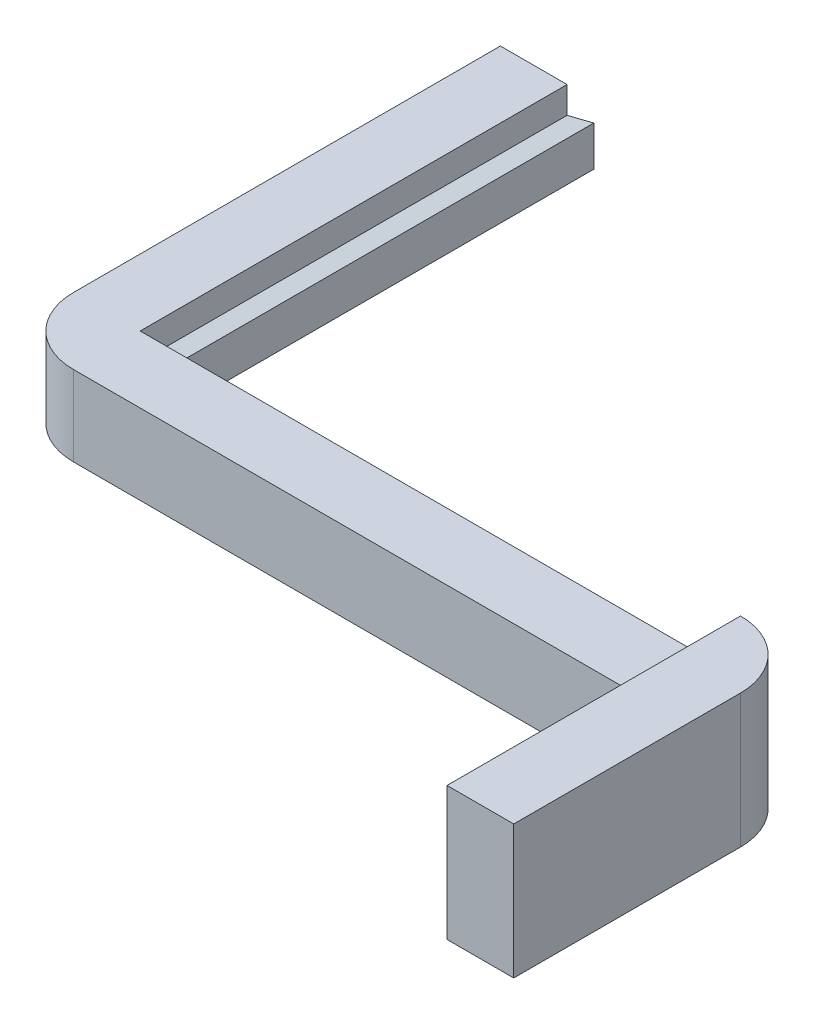
ISO-10303-21;
HEADER;
FILE_DESCRIPTION(('STEP AP214'),'2;1');
FILE_NAME('part.step','',(''),(''),'','','');
FILE_SCHEMA(('AUTOMOTIVE_DESIGN { 1 0 10303 214 1 1 1 1 }'));
ENDSEC;
DATA;
#1=APPLICATION_CONTEXT('core data for automotive mechanical design processes');
#2=APPLICATION_PROTOCOL_DEFINITION('international standard','automotive_design',2000,#1);
#3=PRODUCT_CONTEXT('',#1,'mechanical');
#4=PRODUCT('Part','Part','',(#3));
#5=PRODUCT_RELATED_PRODUCT_CATEGORY('part','',(#4));
#6=PRODUCT_DEFINITION_FORMATION('','',#4);
#7=PRODUCT_DEFINITION_CONTEXT('part definition',#1,'design');
#8=PRODUCT_DEFINITION('design','',#6,#7);
#9=PRODUCT_DEFINITION_SHAPE('','',#8);
#10=(LENGTH_UNIT() NAMED_UNIT(*) SI_UNIT(.MILLI.,.METRE.));
#11=(NAMED_UNIT(*) PLANE_ANGLE_UNIT() SI_UNIT($,.RADIAN.));
#12=(NAMED_UNIT(*) SI_UNIT($,.STERADIAN.) SOLID_ANGLE_UNIT());
#13=UNCERTAINTY_MEASURE_WITH_UNIT(LENGTH_MEASURE(1.E-05),#10,'distance_accuracy_value','');
#14=(GEOMETRIC_REPRESENTATION_CONTEXT(3) GLOBAL_UNCERTAINTY_ASSIGNED_CONTEXT((#13)) GLOBAL_UNIT_ASSIGNED_CONTEXT((#10,
#11,#12)) REPRESENTATION_CONTEXT('',''));
#15=CARTESIAN_POINT('',(0.,0.,0.));
#16=DIRECTION('',(0.,0.,1.));
#17=DIRECTION('',(1.,0.,0.));
#18=AXIS2_PLACEMENT_3D('',#15,#16,#17);
#19=CARTESIAN_POINT('',(0.,0.,0.));
#20=DIRECTION('',(0.,0.,-1.));
#21=DIRECTION('',(-1.,0.,0.));
#22=AXIS2_PLACEMENT_3D('',#19,#20,#21);
#23=PLANE('',#22);
#24=DIRECTION('',(0.,-1.,0.));
#25=VECTOR('',#24,1.);
#26=CARTESIAN_POINT('',(-20.5,1.5,0.));
#27=LINE('',#26,#25);
#28=CARTESIAN_POINT('',(-20.5,1.5,0.));
#29=VERTEX_POINT('',#28);
#30=CARTESIAN_POINT('',(-20.5,-1.5,0.));
#31=VERTEX_POINT('',#30);
#32=EDGE_CURVE('E155',#29,#31,#27,.T.);
#33=ORIENTED_EDGE('',*,*,#32,.F.);
#34=DIRECTION('',(0.970142500145332,0.242535625036333,0.));
#35=VECTOR('',#34,1.);
#36=CARTESIAN_POINT('',(-22.5,1.,0.));
#37=LINE('',#36,#35);
#38=CARTESIAN_POINT('',(-22.5,1.,0.));
#39=VERTEX_POINT('',#38);
#40=EDGE_CURVE('E164',#39,#29,#37,.T.);
#41=ORIENTED_EDGE('',*,*,#40,.F.);
#42=DIRECTION('',(0.,-1.,0.));
#43=VECTOR('',#42,1.);
#44=CARTESIAN_POINT('',(-22.5,3.,0.));
#45=LINE('',#44,#43);
#46=CARTESIAN_POINT('',(-22.5,3.,0.));
#47=VERTEX_POINT('',#46);
#48=EDGE_CURVE('E264',#47,#39,#45,.T.);
#49=ORIENTED_EDGE('',*,*,#48,.F.);
#50=DIRECTION('',(-1.,0.,0.));
#51=VECTOR('',#50,1.);
#52=CARTESIAN_POINT('',(22.5,3.,0.));
#53=LINE('',#52,#51);
#54=CARTESIAN_POINT('',(22.5,3.,0.));
#55=VERTEX_POINT('',#54);
#56=EDGE_CURVE('E255',#55,#47,#53,.T.);
#57=ORIENTED_EDGE('',*,*,#56,.F.);
#58=DIRECTION('',(0.,1.,0.));
#59=VECTOR('',#58,1.);
#60=CARTESIAN_POINT('',(22.5,-3.,0.));
#61=LINE('',#60,#59);
#62=CARTESIAN_POINT('',(22.5,-3.,0.));
#63=VERTEX_POINT('',#62);
#64=EDGE_CURVE('E52',#55,#63,#61,.F.);
#65=ORIENTED_EDGE('',*,*,#64,.T.);
#66=DIRECTION('',(1.,0.,0.));
#67=VECTOR('',#66,1.);
#68=CARTESIAN_POINT('',(22.5,-3.,0.));
#69=LINE('',#68,#67);
#70=CARTESIAN_POINT('',(-22.5,-3.,0.));
#71=VERTEX_POINT('',#70);
#72=EDGE_CURVE('E267',#71,#63,#69,.T.);
#73=ORIENTED_EDGE('',*,*,#72,.F.);
#74=CARTESIAN_POINT('',(-22.5,-1.,0.));
#75=VERTEX_POINT('',#74);
#76=EDGE_CURVE('E249',#75,#71,#45,.T.);
#77=ORIENTED_EDGE('',*,*,#76,.F.);
#78=DIRECTION('',(-0.970142500145332,0.242535625036333,0.));
#79=VECTOR('',#78,1.);
#80=CARTESIAN_POINT('',(-20.5,-1.5,0.));
#81=LINE('',#80,#79);
#82=EDGE_CURVE('E173',#31,#75,#81,.T.);
#83=ORIENTED_EDGE('',*,*,#82,.F.);
#84=EDGE_LOOP('',(#33,#41,#49,#57,#65,#73,#77,#83));
#85=FACE_BOUND('',#84,.T.);
#86=ADVANCED_FACE('F43',(#85),#23,.T.);
#87=CARTESIAN_POINT('',(-22.5,0.,0.));
#88=DIRECTION('',(1.,0.,0.));
#89=DIRECTION('',(0.,0.,-1.));
#90=AXIS2_PLACEMENT_3D('',#87,#88,#89);
#91=PLANE('',#90);
#92=ORIENTED_EDGE('',*,*,#48,.T.);
#93=DIRECTION('',(0.,0.,1.));
#94=VECTOR('',#93,1.);
#95=CARTESIAN_POINT('',(-22.5,1.,-35.605551275464));
#96=LINE('',#95,#94);
#97=CARTESIAN_POINT('',(-22.5,1.,-32.));
#98=VERTEX_POINT('',#97);
#99=EDGE_CURVE('E167',#98,#39,#96,.T.);
#100=ORIENTED_EDGE('',*,*,#99,.F.);
#101=DIRECTION('',(0.,-1.,0.));
#102=VECTOR('',#101,1.);
#103=CARTESIAN_POINT('',(-22.5,2.99999999999999,-32.));
#104=LINE('',#103,#102);
#105=CARTESIAN_POINT('',(-22.5,2.99999999999999,-32.));
#106=VERTEX_POINT('',#105);
#107=EDGE_CURVE('E235',#106,#98,#104,.T.);
#108=ORIENTED_EDGE('',*,*,#107,.F.);
#109=DIRECTION('',(0.,0.,-1.));
#110=VECTOR('',#109,1.);
#111=CARTESIAN_POINT('',(-22.5,3.,5.));
#112=LINE('',#111,#110);
#113=EDGE_CURVE('E219',#47,#106,#112,.T.);
#114=ORIENTED_EDGE('',*,*,#113,.F.);
#115=EDGE_LOOP('',(#92,#100,#108,#114));
#116=FACE_BOUND('',#115,.T.);
#117=ADVANCED_FACE('F325',(#116),#91,.T.);
#118=CARTESIAN_POINT('',(-22.5,-1.,-32.));
#119=VERTEX_POINT('',#118);
#120=CARTESIAN_POINT('',(-22.5,-3.00000000000001,-32.));
#121=VERTEX_POINT('',#120);
#122=EDGE_CURVE('E234',#119,#121,#104,.T.);
#123=ORIENTED_EDGE('',*,*,#122,.F.);
#124=DIRECTION('',(0.,0.,1.));
#125=VECTOR('',#124,1.);
#126=CARTESIAN_POINT('',(-22.5,-1.,-35.605551275464));
#127=LINE('',#126,#125);
#128=EDGE_CURVE('E59',#119,#75,#127,.T.);
#129=ORIENTED_EDGE('',*,*,#128,.T.);
#130=ORIENTED_EDGE('',*,*,#76,.T.);
#131=DIRECTION('',(0.,0.,1.));
#132=VECTOR('',#131,1.);
#133=CARTESIAN_POINT('',(-22.5,-3.,5.));
#134=LINE('',#133,#132);
#135=EDGE_CURVE('E224',#121,#71,#134,.T.);
#136=ORIENTED_EDGE('',*,*,#135,.F.);
#137=EDGE_LOOP('',(#123,#129,#130,#136));
#138=FACE_BOUND('',#137,.T.);
#139=ADVANCED_FACE('F309',(#138),#91,.T.);
#140=CARTESIAN_POINT('',(22.5,-3.,5.));
#141=DIRECTION('',(0.,1.,0.));
#142=DIRECTION('',(-1.,0.,0.));
#143=AXIS2_PLACEMENT_3D('',#140,#141,#142);
#144=PLANE('',#143);
#145=ORIENTED_EDGE('',*,*,#72,.T.);
#146=CARTESIAN_POINT('',(22.5,-3.,5.));
#147=DIRECTION('',(0.,1.,0.));
#148=DIRECTION('',(-1.,0.,0.));
#149=AXIS2_PLACEMENT_3D('',#146,#147,#148);
#150=CIRCLE('',#149,5.);
#151=CARTESIAN_POINT('',(27.5,-3.,5.));
#152=VERTEX_POINT('',#151);
#153=EDGE_CURVE('E11',#63,#152,#150,.F.);
#154=ORIENTED_EDGE('',*,*,#153,.T.);
#155=DIRECTION('',(0.,0.,-1.));
#156=VECTOR('',#155,1.);
#157=CARTESIAN_POINT('',(27.5,-3.,0.));
#158=LINE('',#157,#156);
#159=CARTESIAN_POINT('',(27.5,-3.,22.));
#160=VERTEX_POINT('',#159);
#161=EDGE_CURVE('E193',#160,#152,#158,.T.);
#162=ORIENTED_EDGE('',*,*,#161,.F.);
#163=DIRECTION('',(-1.,0.,0.));
#164=VECTOR('',#163,1.);
#165=CARTESIAN_POINT('',(27.5,-3.,22.));
#166=LINE('',#165,#164);
#167=CARTESIAN_POINT('',(22.5,-3.,22.));
#168=VERTEX_POINT('',#167);
#169=EDGE_CURVE('E197',#160,#168,#166,.T.);
#170=ORIENTED_EDGE('',*,*,#169,.T.);
#171=DIRECTION('',(0.,0.,-1.));
#172=VECTOR('',#171,1.);
#173=CARTESIAN_POINT('',(22.5,-3.,0.));
#174=LINE('',#173,#172);
#175=CARTESIAN_POINT('',(22.5,-3.,5.));
#176=VERTEX_POINT('',#175);
#177=EDGE_CURVE('E190',#168,#176,#174,.T.);
#178=ORIENTED_EDGE('',*,*,#177,.T.);
#179=DIRECTION('',(1.,0.,0.));
#180=VECTOR('',#179,1.);
#181=CARTESIAN_POINT('',(22.5,-3.,5.));
#182=LINE('',#181,#180);
#183=CARTESIAN_POINT('',(-22.5,-3.,5.));
#184=VERTEX_POINT('',#183);
#185=EDGE_CURVE('E250',#184,#176,#182,.T.);
#186=ORIENTED_EDGE('',*,*,#185,.F.);
#187=CARTESIAN_POINT('',(-22.5,-3.,0.));
#188=DIRECTION('',(0.,1.,0.));
#189=DIRECTION('',(-1.,0.,0.));
#190=AXIS2_PLACEMENT_3D('',#187,#188,#189);
#191=CIRCLE('',#190,5.);
#192=CARTESIAN_POINT('',(-27.5,-3.,0.));
#193=VERTEX_POINT('',#192);
#194=EDGE_CURVE('E285',#184,#193,#191,.F.);
#195=ORIENTED_EDGE('',*,*,#194,.T.);
#196=DIRECTION('',(0.,0.,1.));
#197=VECTOR('',#196,1.);
#198=CARTESIAN_POINT('',(-27.5,-3.,5.));
#199=LINE('',#198,#197);
#200=CARTESIAN_POINT('',(-27.5,-3.00000000000001,-32.));
#201=VERTEX_POINT('',#200);
#202=EDGE_CURVE('E227',#201,#193,#199,.T.);
#203=ORIENTED_EDGE('',*,*,#202,.F.);
#204=DIRECTION('',(1.,0.,0.));
#205=VECTOR('',#204,1.);
#206=CARTESIAN_POINT('',(-27.5,-3.00000000000001,-32.));
#207=LINE('',#206,#205);
#208=EDGE_CURVE('E231',#201,#121,#207,.T.);
#209=ORIENTED_EDGE('',*,*,#208,.T.);
#210=ORIENTED_EDGE('',*,*,#135,.T.);
#211=EDGE_LOOP('',(#145,#154,#162,#170,#178,#186,#195,#203,#209,#210));
#212=FACE_BOUND('',#211,.T.);
#213=ADVANCED_FACE('F311',(#212),#144,.F.);
#214=CARTESIAN_POINT('',(22.5,3.,5.));
#215=DIRECTION('',(0.,-1.,0.));
#216=DIRECTION('',(1.,0.,0.));
#217=AXIS2_PLACEMENT_3D('',#214,#215,#216);
#218=PLANE('',#217);
#219=DIRECTION('',(0.,0.,-1.));
#220=VECTOR('',#219,1.);
#221=CARTESIAN_POINT('',(-27.5,3.,5.));
#222=LINE('',#221,#220);
#223=CARTESIAN_POINT('',(-27.5,3.,0.));
#224=VERTEX_POINT('',#223);
#225=CARTESIAN_POINT('',(-27.5,2.99999999999999,-32.));
#226=VERTEX_POINT('',#225);
#227=EDGE_CURVE('E220',#224,#226,#222,.T.);
#228=ORIENTED_EDGE('',*,*,#227,.F.);
#229=CARTESIAN_POINT('',(-22.5,3.,0.));
#230=DIRECTION('',(0.,-1.,0.));
#231=DIRECTION('',(1.,0.,0.));
#232=AXIS2_PLACEMENT_3D('',#229,#230,#231);
#233=CIRCLE('',#232,5.);
#234=CARTESIAN_POINT('',(-22.5,3.,5.));
#235=VERTEX_POINT('',#234);
#236=EDGE_CURVE('E279',#224,#235,#233,.F.);
#237=ORIENTED_EDGE('',*,*,#236,.T.);
#238=DIRECTION('',(-1.,0.,0.));
#239=VECTOR('',#238,1.);
#240=CARTESIAN_POINT('',(22.5,3.,5.));
#241=LINE('',#240,#239);
#242=CARTESIAN_POINT('',(22.5,3.,5.));
#243=VERTEX_POINT('',#242);
#244=EDGE_CURVE('E259',#243,#235,#241,.T.);
#245=ORIENTED_EDGE('',*,*,#244,.F.);
#246=DIRECTION('',(0.,0.,-1.));
#247=VECTOR('',#246,1.);
#248=CARTESIAN_POINT('',(22.5,3.,5.));
#249=LINE('',#248,#247);
#250=EDGE_CURVE('E263',#243,#55,#249,.T.);
#251=ORIENTED_EDGE('',*,*,#250,.T.);
#252=ORIENTED_EDGE('',*,*,#56,.T.);
#253=ORIENTED_EDGE('',*,*,#113,.T.);
#254=DIRECTION('',(1.,0.,0.));
#255=VECTOR('',#254,1.);
#256=CARTESIAN_POINT('',(-27.5,2.99999999999999,-32.));
#257=LINE('',#256,#255);
#258=EDGE_CURVE('E245',#226,#106,#257,.T.);
#259=ORIENTED_EDGE('',*,*,#258,.F.);
#260=EDGE_LOOP('',(#228,#237,#245,#251,#252,#253,#259));
#261=FACE_BOUND('',#260,.T.);
#262=ADVANCED_FACE('F322',(#261),#218,.F.);
#263=CARTESIAN_POINT('',(0.,0.,5.));
#264=DIRECTION('',(0.,0.,-1.));
#265=DIRECTION('',(-1.,0.,0.));
#266=AXIS2_PLACEMENT_3D('',#263,#264,#265);
#267=PLANE('',#266);
#268=ORIENTED_EDGE('',*,*,#244,.T.);
#269=DIRECTION('',(0.,1.,0.));
#270=VECTOR('',#269,1.);
#271=CARTESIAN_POINT('',(-22.5,0.,5.));
#272=LINE('',#271,#270);
#273=EDGE_CURVE('E282',#235,#184,#272,.F.);
#274=ORIENTED_EDGE('',*,*,#273,.T.);
#275=ORIENTED_EDGE('',*,*,#185,.T.);
#276=DIRECTION('',(0.,1.,0.));
#277=VECTOR('',#276,1.);
#278=CARTESIAN_POINT('',(22.5,3.,5.));
#279=LINE('',#278,#277);
#280=EDGE_CURVE('E254',#176,#243,#279,.T.);
#281=ORIENTED_EDGE('',*,*,#280,.T.);
#282=EDGE_LOOP('',(#268,#274,#275,#281));
#283=FACE_BOUND('',#282,.T.);
#284=ADVANCED_FACE('F345',(#283),#267,.F.);
#285=CARTESIAN_POINT('',(-27.5,2.99999999999999,-32.));
#286=DIRECTION('',(0.,0.,1.));
#287=DIRECTION('',(1.,0.,0.));
#288=AXIS2_PLACEMENT_3D('',#285,#286,#287);
#289=PLANE('',#288);
#290=ORIENTED_EDGE('',*,*,#107,.T.);
#291=DIRECTION('',(-0.970142500145332,-0.242535625036333,0.));
#292=VECTOR('',#291,1.);
#293=CARTESIAN_POINT('',(-22.5,1.,-32.));
#294=LINE('',#293,#292);
#295=CARTESIAN_POINT('',(-20.5,1.5,-32.));
#296=VERTEX_POINT('',#295);
#297=EDGE_CURVE('E203',#296,#98,#294,.T.);
#298=ORIENTED_EDGE('',*,*,#297,.F.);
#299=DIRECTION('',(0.,1.,0.));
#300=VECTOR('',#299,1.);
#301=CARTESIAN_POINT('',(-20.5,1.5,-32.));
#302=LINE('',#301,#300);
#303=CARTESIAN_POINT('',(-20.5,-1.5,-32.));
#304=VERTEX_POINT('',#303);
#305=EDGE_CURVE('E157',#304,#296,#302,.T.);
#306=ORIENTED_EDGE('',*,*,#305,.F.);
#307=DIRECTION('',(0.970142500145332,-0.242535625036333,0.));
#308=VECTOR('',#307,1.);
#309=CARTESIAN_POINT('',(-20.5,-1.5,-32.));
#310=LINE('',#309,#308);
#311=EDGE_CURVE('E160',#119,#304,#310,.T.);
#312=ORIENTED_EDGE('',*,*,#311,.F.);
#313=ORIENTED_EDGE('',*,*,#122,.T.);
#314=ORIENTED_EDGE('',*,*,#208,.F.);
#315=DIRECTION('',(0.,-1.,0.));
#316=VECTOR('',#315,1.);
#317=CARTESIAN_POINT('',(-27.5,2.99999999999999,-32.));
#318=LINE('',#317,#316);
#319=EDGE_CURVE('E223',#226,#201,#318,.T.);
#320=ORIENTED_EDGE('',*,*,#319,.F.);
#321=ORIENTED_EDGE('',*,*,#258,.T.);
#322=EDGE_LOOP('',(#290,#298,#306,#312,#313,#314,#320,#321));
#323=FACE_BOUND('',#322,.T.);
#324=ADVANCED_FACE('F305',(#323),#289,.F.);
#325=CARTESIAN_POINT('',(-27.5,0.,0.));
#326=DIRECTION('',(1.,0.,0.));
#327=DIRECTION('',(0.,0.,-1.));
#328=AXIS2_PLACEMENT_3D('',#325,#326,#327);
#329=PLANE('',#328);
#330=ORIENTED_EDGE('',*,*,#202,.T.);
#331=DIRECTION('',(0.,1.,0.));
#332=VECTOR('',#331,1.);
#333=CARTESIAN_POINT('',(-27.5,0.,0.));
#334=LINE('',#333,#332);
#335=EDGE_CURVE('E275',#193,#224,#334,.T.);
#336=ORIENTED_EDGE('',*,*,#335,.T.);
#337=ORIENTED_EDGE('',*,*,#227,.T.);
#338=ORIENTED_EDGE('',*,*,#319,.T.);
#339=EDGE_LOOP('',(#330,#336,#337,#338));
#340=FACE_BOUND('',#339,.T.);
#341=ADVANCED_FACE('F318',(#340),#329,.F.);
#342=CARTESIAN_POINT('',(-22.5,0.,0.));
#343=DIRECTION('',(0.,1.,0.));
#344=DIRECTION('',(0.,0.,1.));
#345=AXIS2_PLACEMENT_3D('',#342,#343,#344);
#346=CYLINDRICAL_SURFACE('',#345,5.);
#347=ORIENTED_EDGE('',*,*,#194,.F.);
#348=ORIENTED_EDGE('',*,*,#273,.F.);
#349=ORIENTED_EDGE('',*,*,#236,.F.);
#350=ORIENTED_EDGE('',*,*,#335,.F.);
#351=EDGE_LOOP('',(#347,#348,#349,#350));
#352=FACE_BOUND('',#351,.T.);
#353=ADVANCED_FACE('F349',(#352),#346,.T.);
#354=CARTESIAN_POINT('',(22.5,0.,0.));
#355=DIRECTION('',(-1.,0.,0.));
#356=DIRECTION('',(0.,0.,1.));
#357=AXIS2_PLACEMENT_3D('',#354,#355,#356);
#358=PLANE('',#357);
#359=ORIENTED_EDGE('',*,*,#250,.F.);
#360=ORIENTED_EDGE('',*,*,#280,.F.);
#361=ORIENTED_EDGE('',*,*,#177,.F.);
#362=DIRECTION('',(0.,-1.,0.));
#363=VECTOR('',#362,1.);
#364=CARTESIAN_POINT('',(22.5,7.,22.));
#365=LINE('',#364,#363);
#366=CARTESIAN_POINT('',(22.5,7.,22.));
#367=VERTEX_POINT('',#366);
#368=EDGE_CURVE('E206',#367,#168,#365,.T.);
#369=ORIENTED_EDGE('',*,*,#368,.F.);
#370=DIRECTION('',(0.,0.,1.));
#371=VECTOR('',#370,1.);
#372=CARTESIAN_POINT('',(22.5,7.,0.));
#373=LINE('',#372,#371);
#374=CARTESIAN_POINT('',(22.5,7.,0.));
#375=VERTEX_POINT('',#374);
#376=EDGE_CURVE('E202',#375,#367,#373,.T.);
#377=ORIENTED_EDGE('',*,*,#376,.F.);
#378=DIRECTION('',(0.,1.,0.));
#379=VECTOR('',#378,1.);
#380=CARTESIAN_POINT('',(22.5,7.,0.));
#381=LINE('',#380,#379);
#382=EDGE_CURVE('E198',#55,#375,#381,.T.);
#383=ORIENTED_EDGE('',*,*,#382,.F.);
#384=EDGE_LOOP('',(#359,#360,#361,#369,#377,#383));
#385=FACE_BOUND('',#384,.T.);
#386=ADVANCED_FACE('F341',(#385),#358,.T.);
#387=CARTESIAN_POINT('',(27.5,7.,0.));
#388=DIRECTION('',(0.,-1.,0.));
#389=DIRECTION('',(0.,0.,-1.));
#390=AXIS2_PLACEMENT_3D('',#387,#388,#389);
#391=PLANE('',#390);
#392=DIRECTION('',(0.,0.,1.));
#393=VECTOR('',#392,1.);
#394=CARTESIAN_POINT('',(27.5,7.,0.));
#395=LINE('',#394,#393);
#396=CARTESIAN_POINT('',(27.5,7.,5.));
#397=VERTEX_POINT('',#396);
#398=CARTESIAN_POINT('',(27.5,7.,22.));
#399=VERTEX_POINT('',#398);
#400=EDGE_CURVE('E186',#397,#399,#395,.T.);
#401=ORIENTED_EDGE('',*,*,#400,.F.);
#402=CARTESIAN_POINT('',(22.5,7.,5.));
#403=DIRECTION('',(0.,-1.,0.));
#404=DIRECTION('',(0.,0.,-1.));
#405=AXIS2_PLACEMENT_3D('',#402,#403,#404);
#406=CIRCLE('',#405,5.);
#407=EDGE_CURVE('E292',#397,#375,#406,.F.);
#408=ORIENTED_EDGE('',*,*,#407,.T.);
#409=ORIENTED_EDGE('',*,*,#376,.T.);
#410=DIRECTION('',(-1.,0.,0.));
#411=VECTOR('',#410,1.);
#412=CARTESIAN_POINT('',(27.5,7.,22.));
#413=LINE('',#412,#411);
#414=EDGE_CURVE('E215',#399,#367,#413,.T.);
#415=ORIENTED_EDGE('',*,*,#414,.F.);
#416=EDGE_LOOP('',(#401,#408,#409,#415));
#417=FACE_BOUND('',#416,.T.);
#418=ADVANCED_FACE('F355',(#417),#391,.F.);
#419=CARTESIAN_POINT('',(27.5,7.,22.));
#420=DIRECTION('',(0.,0.,-1.));
#421=DIRECTION('',(-1.,0.,0.));
#422=AXIS2_PLACEMENT_3D('',#419,#420,#421);
#423=PLANE('',#422);
#424=ORIENTED_EDGE('',*,*,#368,.T.);
#425=ORIENTED_EDGE('',*,*,#169,.F.);
#426=DIRECTION('',(0.,-1.,0.));
#427=VECTOR('',#426,1.);
#428=CARTESIAN_POINT('',(27.5,7.,22.));
#429=LINE('',#428,#427);
#430=EDGE_CURVE('E189',#399,#160,#429,.T.);
#431=ORIENTED_EDGE('',*,*,#430,.F.);
#432=ORIENTED_EDGE('',*,*,#414,.T.);
#433=EDGE_LOOP('',(#424,#425,#431,#432));
#434=FACE_BOUND('',#433,.T.);
#435=ADVANCED_FACE('F336',(#434),#423,.F.);
#436=CARTESIAN_POINT('',(27.5,0.,0.));
#437=DIRECTION('',(-1.,0.,0.));
#438=DIRECTION('',(0.,0.,1.));
#439=AXIS2_PLACEMENT_3D('',#436,#437,#438);
#440=PLANE('',#439);
#441=ORIENTED_EDGE('',*,*,#161,.T.);
#442=DIRECTION('',(0.,1.,0.));
#443=VECTOR('',#442,1.);
#444=CARTESIAN_POINT('',(27.5,7.,5.));
#445=LINE('',#444,#443);
#446=EDGE_CURVE('E288',#152,#397,#445,.T.);
#447=ORIENTED_EDGE('',*,*,#446,.T.);
#448=ORIENTED_EDGE('',*,*,#400,.T.);
#449=ORIENTED_EDGE('',*,*,#430,.T.);
#450=EDGE_LOOP('',(#441,#447,#448,#449));
#451=FACE_BOUND('',#450,.T.);
#452=ADVANCED_FACE('F330',(#451),#440,.F.);
#453=CARTESIAN_POINT('',(22.5,0.,5.));
#454=DIRECTION('',(0.,-1.,0.));
#455=DIRECTION('',(0.,0.,-1.));
#456=AXIS2_PLACEMENT_3D('',#453,#454,#455);
#457=CYLINDRICAL_SURFACE('',#456,5.);
#458=ORIENTED_EDGE('',*,*,#64,.F.);
#459=ORIENTED_EDGE('',*,*,#382,.T.);
#460=ORIENTED_EDGE('',*,*,#407,.F.);
#461=ORIENTED_EDGE('',*,*,#446,.F.);
#462=ORIENTED_EDGE('',*,*,#153,.F.);
#463=EDGE_LOOP('',(#458,#459,#460,#461,#462));
#464=FACE_BOUND('',#463,.T.);
#465=ADVANCED_FACE('F45',(#464),#457,.T.);
#466=CARTESIAN_POINT('',(-22.5,1.,-35.605551275464));
#467=DIRECTION('',(0.242535625036333,-0.970142500145332,0.));
#468=DIRECTION('',(0.970142500145332,0.242535625036333,0.));
#469=AXIS2_PLACEMENT_3D('',#466,#467,#468);
#470=PLANE('',#469);
#471=DIRECTION('',(0.,0.,1.));
#472=VECTOR('',#471,1.);
#473=CARTESIAN_POINT('',(-20.5,1.5,-35.605551275464));
#474=LINE('',#473,#472);
#475=EDGE_CURVE('E150',#296,#29,#474,.T.);
#476=ORIENTED_EDGE('',*,*,#475,.F.);
#477=ORIENTED_EDGE('',*,*,#297,.T.);
#478=ORIENTED_EDGE('',*,*,#99,.T.);
#479=ORIENTED_EDGE('',*,*,#40,.T.);
#480=EDGE_LOOP('',(#476,#477,#478,#479));
#481=FACE_BOUND('',#480,.T.);
#482=ADVANCED_FACE('F165',(#481),#470,.F.);
#483=CARTESIAN_POINT('',(-20.5,1.5,-35.605551275464));
#484=DIRECTION('',(-1.,0.,0.));
#485=DIRECTION('',(0.,0.,1.));
#486=AXIS2_PLACEMENT_3D('',#483,#484,#485);
#487=PLANE('',#486);
#488=DIRECTION('',(0.,0.,1.));
#489=VECTOR('',#488,1.);
#490=CARTESIAN_POINT('',(-20.5,-1.5,-35.605551275464));
#491=LINE('',#490,#489);
#492=EDGE_CURVE('E161',#304,#31,#491,.T.);
#493=ORIENTED_EDGE('',*,*,#492,.F.);
#494=ORIENTED_EDGE('',*,*,#305,.T.);
#495=ORIENTED_EDGE('',*,*,#475,.T.);
#496=ORIENTED_EDGE('',*,*,#32,.T.);
#497=EDGE_LOOP('',(#493,#494,#495,#496));
#498=FACE_BOUND('',#497,.T.);
#499=ADVANCED_FACE('F153',(#498),#487,.F.);
#500=CARTESIAN_POINT('',(-20.5,-1.5,-35.605551275464));
#501=DIRECTION('',(0.242535625036333,0.970142500145332,0.));
#502=DIRECTION('',(-0.970142500145332,0.242535625036333,0.));
#503=AXIS2_PLACEMENT_3D('',#500,#501,#502);
#504=PLANE('',#503);
#505=ORIENTED_EDGE('',*,*,#128,.F.);
#506=ORIENTED_EDGE('',*,*,#311,.T.);
#507=ORIENTED_EDGE('',*,*,#492,.T.);
#508=ORIENTED_EDGE('',*,*,#82,.T.);
#509=EDGE_LOOP('',(#505,#506,#507,#508));
#510=FACE_BOUND('',#509,.T.);
#511=ADVANCED_FACE('F302',(#510),#504,.F.);
#512=CLOSED_SHELL('',(#86,#117,#139,#213,#262,#284,#324,#341,#353,#386,#418,#435,#452,#465,#482,
#499,#511));
#513=MANIFOLD_SOLID_BREP('B2',#512);
#514=ADVANCED_BREP_SHAPE_REPRESENTATION('',(#18,#513),#14);
#515=SHAPE_DEFINITION_REPRESENTATION(#9,#514);
ENDSEC;
END-ISO-10303-21;
